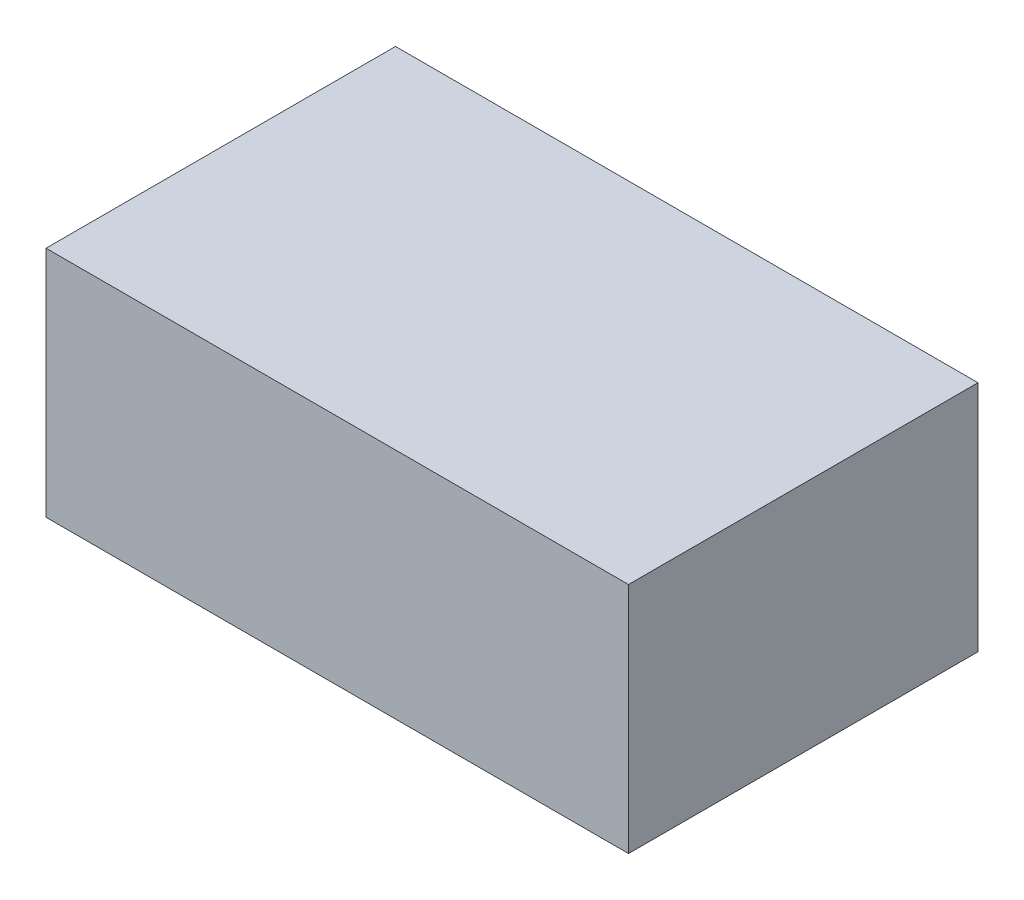
ISO-10303-21;
HEADER;
FILE_DESCRIPTION(('STEP AP214'),'2;1');
FILE_NAME('part.step','',(''),(''),'','','');
FILE_SCHEMA(('AUTOMOTIVE_DESIGN { 1 0 10303 214 1 1 1 1 }'));
ENDSEC;
DATA;
#1=APPLICATION_CONTEXT('core data for automotive mechanical design processes');
#2=APPLICATION_PROTOCOL_DEFINITION('international standard','automotive_design',2000,#1);
#3=PRODUCT_CONTEXT('',#1,'mechanical');
#4=PRODUCT('Part','Part','',(#3));
#5=PRODUCT_RELATED_PRODUCT_CATEGORY('part','',(#4));
#6=PRODUCT_DEFINITION_FORMATION('','',#4);
#7=PRODUCT_DEFINITION_CONTEXT('part definition',#1,'design');
#8=PRODUCT_DEFINITION('design','',#6,#7);
#9=PRODUCT_DEFINITION_SHAPE('','',#8);
#10=(LENGTH_UNIT() NAMED_UNIT(*) SI_UNIT(.MILLI.,.METRE.));
#11=(NAMED_UNIT(*) PLANE_ANGLE_UNIT() SI_UNIT($,.RADIAN.));
#12=(NAMED_UNIT(*) SI_UNIT($,.STERADIAN.) SOLID_ANGLE_UNIT());
#13=UNCERTAINTY_MEASURE_WITH_UNIT(LENGTH_MEASURE(1.E-05),#10,'distance_accuracy_value','');
#14=(GEOMETRIC_REPRESENTATION_CONTEXT(3) GLOBAL_UNCERTAINTY_ASSIGNED_CONTEXT((#13)) GLOBAL_UNIT_ASSIGNED_CONTEXT((#10,
#11,#12)) REPRESENTATION_CONTEXT('',''));
#15=CARTESIAN_POINT('',(0.,0.,0.));
#16=DIRECTION('',(0.,0.,1.));
#17=DIRECTION('',(1.,0.,0.));
#18=AXIS2_PLACEMENT_3D('',#15,#16,#17);
#19=CARTESIAN_POINT('',(0.,0.,0.));
#20=DIRECTION('',(0.,1.,0.));
#21=DIRECTION('',(0.,0.,1.));
#22=AXIS2_PLACEMENT_3D('',#19,#20,#21);
#23=PLANE('',#22);
#24=DIRECTION('',(-1.,0.,0.));
#25=VECTOR('',#24,1.);
#26=CARTESIAN_POINT('',(3.28353129210385,0.,-14.4048659910961));
#27=LINE('',#26,#25);
#28=CARTESIAN_POINT('',(14.9430099475817,0.,-14.4048659910961));
#29=VERTEX_POINT('',#28);
#30=CARTESIAN_POINT('',(3.28353129210385,0.,-14.4048659910961));
#31=VERTEX_POINT('',#30);
#32=EDGE_CURVE('E79',#29,#31,#27,.T.);
#33=ORIENTED_EDGE('',*,*,#32,.F.);
#34=DIRECTION('',(0.576438296507563,0.,-0.817140679638127));
#35=VECTOR('',#34,1.);
#36=CARTESIAN_POINT('',(12.692574419648,0.,-11.2147198333566));
#37=LINE('',#36,#35);
#38=CARTESIAN_POINT('',(8.77961574684437,0.,-5.66783349935892));
#39=VERTEX_POINT('',#38);
#40=EDGE_CURVE('E177',#39,#29,#37,.T.);
#41=ORIENTED_EDGE('',*,*,#40,.F.);
#42=CARTESIAN_POINT('',(1.28453532487361,0.,-10.9551132766199));
#43=DIRECTION('',(0.,1.,0.));
#44=DIRECTION('',(0.,0.,-1.));
#45=AXIS2_PLACEMENT_3D('',#42,#43,#44);
#46=CIRCLE('',#45,9.17232565791483);
#47=CARTESIAN_POINT('',(3.28353129210386,0.,-2.00326580820093));
#48=VERTEX_POINT('',#47);
#49=EDGE_CURVE('E174',#48,#39,#46,.T.);
#50=ORIENTED_EDGE('',*,*,#49,.F.);
#51=DIRECTION('',(0.,0.,1.));
#52=VECTOR('',#51,1.);
#53=CARTESIAN_POINT('',(3.28353129210385,0.,-14.4048659910961));
#54=LINE('',#53,#52);
#55=EDGE_CURVE('E203',#31,#48,#54,.T.);
#56=ORIENTED_EDGE('',*,*,#55,.F.);
#57=EDGE_LOOP('',(#33,#41,#50,#56));
#58=FACE_BOUND('',#57,.T.);
#59=ADVANCED_FACE('F34',(#58),#23,.F.);
#60=CARTESIAN_POINT('',(3.28353129210385,10.,-14.4048659910961));
#61=DIRECTION('',(1.,0.,0.));
#62=DIRECTION('',(0.,0.,-1.));
#63=AXIS2_PLACEMENT_3D('',#60,#61,#62);
#64=PLANE('',#63);
#65=ORIENTED_EDGE('',*,*,#55,.T.);
#66=DIRECTION('',(0.,-1.,0.));
#67=VECTOR('',#66,1.);
#68=CARTESIAN_POINT('',(3.28353129210386,2.,-2.00326580820093));
#69=LINE('',#68,#67);
#70=CARTESIAN_POINT('',(3.28353129210386,2.,-2.00326580820093));
#71=VERTEX_POINT('',#70);
#72=EDGE_CURVE('E192',#71,#48,#69,.T.);
#73=ORIENTED_EDGE('',*,*,#72,.F.);
#74=DIRECTION('',(0.,0.,-1.));
#75=VECTOR('',#74,1.);
#76=CARTESIAN_POINT('',(3.28353129210386,2.,-1.1899662611907));
#77=LINE('',#76,#75);
#78=CARTESIAN_POINT('',(3.28353129210386,2.,-1.1899662611907));
#79=VERTEX_POINT('',#78);
#80=EDGE_CURVE('E147',#79,#71,#77,.T.);
#81=ORIENTED_EDGE('',*,*,#80,.F.);
#82=DIRECTION('',(0.,-1.,0.));
#83=VECTOR('',#82,1.);
#84=CARTESIAN_POINT('',(3.28353129210386,2.,-1.1899662611907));
#85=LINE('',#84,#83);
#86=CARTESIAN_POINT('',(3.28353129210386,0.,-1.1899662611907));
#87=VERTEX_POINT('',#86);
#88=EDGE_CURVE('E137',#79,#87,#85,.T.);
#89=ORIENTED_EDGE('',*,*,#88,.T.);
#90=CARTESIAN_POINT('',(3.28353129210386,0.,0.595134008903904));
#91=VERTEX_POINT('',#90);
#92=EDGE_CURVE('E183',#87,#91,#54,.T.);
#93=ORIENTED_EDGE('',*,*,#92,.T.);
#94=DIRECTION('',(0.,-1.,0.));
#95=VECTOR('',#94,1.);
#96=CARTESIAN_POINT('',(3.28353129210386,10.,0.595134008903904));
#97=LINE('',#96,#95);
#98=CARTESIAN_POINT('',(3.28353129210386,10.,0.595134008903904));
#99=VERTEX_POINT('',#98);
#100=EDGE_CURVE('E11',#99,#91,#97,.T.);
#101=ORIENTED_EDGE('',*,*,#100,.F.);
#102=DIRECTION('',(0.,0.,1.));
#103=VECTOR('',#102,1.);
#104=CARTESIAN_POINT('',(3.28353129210385,10.,-14.4048659910961));
#105=LINE('',#104,#103);
#106=CARTESIAN_POINT('',(3.28353129210385,10.,-14.4048659910961));
#107=VERTEX_POINT('',#106);
#108=EDGE_CURVE('E195',#107,#99,#105,.T.);
#109=ORIENTED_EDGE('',*,*,#108,.F.);
#110=DIRECTION('',(0.,-1.,0.));
#111=VECTOR('',#110,1.);
#112=CARTESIAN_POINT('',(3.28353129210385,10.,-14.4048659910961));
#113=LINE('',#112,#111);
#114=EDGE_CURVE('E202',#107,#31,#113,.T.);
#115=ORIENTED_EDGE('',*,*,#114,.T.);
#116=EDGE_LOOP('',(#65,#73,#81,#89,#93,#101,#109,#115));
#117=FACE_BOUND('',#116,.T.);
#118=ADVANCED_FACE('F36',(#117),#64,.F.);
#119=CARTESIAN_POINT('',(3.28353129210386,10.,0.595134008903904));
#120=DIRECTION('',(0.,0.,-1.));
#121=DIRECTION('',(-1.,0.,0.));
#122=AXIS2_PLACEMENT_3D('',#119,#120,#121);
#123=PLANE('',#122);
#124=DIRECTION('',(1.,0.,0.));
#125=VECTOR('',#124,1.);
#126=CARTESIAN_POINT('',(3.28353129210386,0.,0.595134008903904));
#127=LINE('',#126,#125);
#128=CARTESIAN_POINT('',(28.2835312921039,0.,0.595134008903904));
#129=VERTEX_POINT('',#128);
#130=EDGE_CURVE('E206',#91,#129,#127,.T.);
#131=ORIENTED_EDGE('',*,*,#130,.T.);
#132=DIRECTION('',(0.,-1.,0.));
#133=VECTOR('',#132,1.);
#134=CARTESIAN_POINT('',(28.2835312921039,10.,0.595134008903904));
#135=LINE('',#134,#133);
#136=CARTESIAN_POINT('',(28.2835312921039,10.,0.595134008903904));
#137=VERTEX_POINT('',#136);
#138=EDGE_CURVE('E42',#137,#129,#135,.T.);
#139=ORIENTED_EDGE('',*,*,#138,.F.);
#140=DIRECTION('',(1.,0.,0.));
#141=VECTOR('',#140,1.);
#142=CARTESIAN_POINT('',(3.28353129210386,10.,0.595134008903904));
#143=LINE('',#142,#141);
#144=EDGE_CURVE('E86',#99,#137,#143,.T.);
#145=ORIENTED_EDGE('',*,*,#144,.F.);
#146=ORIENTED_EDGE('',*,*,#100,.T.);
#147=EDGE_LOOP('',(#131,#139,#145,#146));
#148=FACE_BOUND('',#147,.T.);
#149=ADVANCED_FACE('F250',(#148),#123,.F.);
#150=CARTESIAN_POINT('',(28.2835312921039,10.,-14.4048659910961));
#151=DIRECTION('',(-1.,0.,0.));
#152=DIRECTION('',(0.,0.,1.));
#153=AXIS2_PLACEMENT_3D('',#150,#151,#152);
#154=PLANE('',#153);
#155=DIRECTION('',(0.,0.,-1.));
#156=VECTOR('',#155,1.);
#157=CARTESIAN_POINT('',(28.2835312921039,0.,-14.4048659910961));
#158=LINE('',#157,#156);
#159=CARTESIAN_POINT('',(28.2835312921039,0.,-14.4048659910961));
#160=VERTEX_POINT('',#159);
#161=EDGE_CURVE('E208',#129,#160,#158,.T.);
#162=ORIENTED_EDGE('',*,*,#161,.T.);
#163=DIRECTION('',(0.,-1.,0.));
#164=VECTOR('',#163,1.);
#165=CARTESIAN_POINT('',(28.2835312921039,10.,-14.4048659910961));
#166=LINE('',#165,#164);
#167=CARTESIAN_POINT('',(28.2835312921039,10.,-14.4048659910961));
#168=VERTEX_POINT('',#167);
#169=EDGE_CURVE('E213',#168,#160,#166,.T.);
#170=ORIENTED_EDGE('',*,*,#169,.F.);
#171=DIRECTION('',(0.,0.,-1.));
#172=VECTOR('',#171,1.);
#173=CARTESIAN_POINT('',(28.2835312921039,10.,-14.4048659910961));
#174=LINE('',#173,#172);
#175=EDGE_CURVE('E199',#137,#168,#174,.T.);
#176=ORIENTED_EDGE('',*,*,#175,.F.);
#177=ORIENTED_EDGE('',*,*,#138,.T.);
#178=EDGE_LOOP('',(#162,#170,#176,#177));
#179=FACE_BOUND('',#178,.T.);
#180=ADVANCED_FACE('F219',(#179),#154,.F.);
#181=CARTESIAN_POINT('',(3.28353129210385,10.,-14.4048659910961));
#182=DIRECTION('',(0.,0.,1.));
#183=DIRECTION('',(1.,0.,0.));
#184=AXIS2_PLACEMENT_3D('',#181,#182,#183);
#185=PLANE('',#184);
#186=CARTESIAN_POINT('',(15.9388803821953,0.,-14.4048659910961));
#187=VERTEX_POINT('',#186);
#188=EDGE_CURVE('E197',#160,#187,#27,.T.);
#189=ORIENTED_EDGE('',*,*,#188,.T.);
#190=DIRECTION('',(0.,-1.,0.));
#191=VECTOR('',#190,1.);
#192=CARTESIAN_POINT('',(15.9388803821953,2.,-14.4048659910961));
#193=LINE('',#192,#191);
#194=CARTESIAN_POINT('',(15.9388803821953,2.,-14.4048659910961));
#195=VERTEX_POINT('',#194);
#196=EDGE_CURVE('E186',#195,#187,#193,.T.);
#197=ORIENTED_EDGE('',*,*,#196,.F.);
#198=DIRECTION('',(1.,0.,0.));
#199=VECTOR('',#198,1.);
#200=CARTESIAN_POINT('',(14.9430099475817,2.,-14.4048659910961));
#201=LINE('',#200,#199);
#202=CARTESIAN_POINT('',(14.9430099475817,2.,-14.4048659910961));
#203=VERTEX_POINT('',#202);
#204=EDGE_CURVE('E165',#203,#195,#201,.T.);
#205=ORIENTED_EDGE('',*,*,#204,.F.);
#206=DIRECTION('',(0.,-1.,0.));
#207=VECTOR('',#206,1.);
#208=CARTESIAN_POINT('',(14.9430099475817,2.,-14.4048659910961));
#209=LINE('',#208,#207);
#210=EDGE_CURVE('E188',#203,#29,#209,.T.);
#211=ORIENTED_EDGE('',*,*,#210,.T.);
#212=ORIENTED_EDGE('',*,*,#32,.T.);
#213=ORIENTED_EDGE('',*,*,#114,.F.);
#214=DIRECTION('',(-1.,0.,0.));
#215=VECTOR('',#214,1.);
#216=CARTESIAN_POINT('',(3.28353129210385,10.,-14.4048659910961));
#217=LINE('',#216,#215);
#218=EDGE_CURVE('E58',#168,#107,#217,.T.);
#219=ORIENTED_EDGE('',*,*,#218,.F.);
#220=ORIENTED_EDGE('',*,*,#169,.T.);
#221=EDGE_LOOP('',(#189,#197,#205,#211,#212,#213,#219,#220));
#222=FACE_BOUND('',#221,.T.);
#223=ADVANCED_FACE('F229',(#222),#185,.F.);
#224=CARTESIAN_POINT('',(0.,10.,0.));
#225=DIRECTION('',(0.,1.,0.));
#226=DIRECTION('',(0.,0.,1.));
#227=AXIS2_PLACEMENT_3D('',#224,#225,#226);
#228=PLANE('',#227);
#229=ORIENTED_EDGE('',*,*,#108,.T.);
#230=ORIENTED_EDGE('',*,*,#144,.T.);
#231=ORIENTED_EDGE('',*,*,#175,.T.);
#232=ORIENTED_EDGE('',*,*,#218,.T.);
#233=EDGE_LOOP('',(#229,#230,#231,#232));
#234=FACE_BOUND('',#233,.T.);
#235=ADVANCED_FACE('F235',(#234),#228,.T.);
#236=DIRECTION('',(-0.576438296507563,0.,0.817140679638127));
#237=VECTOR('',#236,1.);
#238=CARTESIAN_POINT('',(9.42822116130713,0.,-5.21028560150604));
#239=LINE('',#238,#237);
#240=CARTESIAN_POINT('',(15.5916153620445,0.,-13.9473180932432));
#241=VERTEX_POINT('',#240);
#242=CARTESIAN_POINT('',(9.42822116130713,0.,-5.21028560150604));
#243=VERTEX_POINT('',#242);
#244=EDGE_CURVE('E153',#241,#243,#239,.T.);
#245=ORIENTED_EDGE('',*,*,#244,.F.);
#246=DIRECTION('',(-0.60456295462272,0.,0.79655736384635));
#247=VECTOR('',#246,1.);
#248=CARTESIAN_POINT('',(15.5916153620445,0.,-13.9473180932432));
#249=LINE('',#248,#247);
#250=EDGE_CURVE('E156',#187,#241,#249,.T.);
#251=ORIENTED_EDGE('',*,*,#250,.F.);
#252=ORIENTED_EDGE('',*,*,#188,.F.);
#253=ORIENTED_EDGE('',*,*,#161,.F.);
#254=ORIENTED_EDGE('',*,*,#130,.F.);
#255=ORIENTED_EDGE('',*,*,#92,.F.);
#256=DIRECTION('',(-0.975962673184686,0.,0.217937744666225));
#257=VECTOR('',#256,1.);
#258=CARTESIAN_POINT('',(3.45651937693268,0.,-1.22859543636059));
#259=LINE('',#258,#257);
#260=CARTESIAN_POINT('',(3.45651937693268,0.,-1.22859543636059));
#261=VERTEX_POINT('',#260);
#262=EDGE_CURVE('E172',#261,#87,#259,.T.);
#263=ORIENTED_EDGE('',*,*,#262,.F.);
#264=CARTESIAN_POINT('',(1.28453532487361,0.,-10.9551132766199));
#265=DIRECTION('',(0.,-1.,0.));
#266=DIRECTION('',(0.,0.,-1.));
#267=AXIS2_PLACEMENT_3D('',#264,#265,#266);
#268=CIRCLE('',#267,9.96607565791483);
#269=EDGE_CURVE('E49',#243,#261,#268,.T.);
#270=ORIENTED_EDGE('',*,*,#269,.F.);
#271=EDGE_LOOP('',(#245,#251,#252,#253,#254,#255,#263,#270));
#272=FACE_BOUND('',#271,.T.);
#273=ADVANCED_FACE('F225',(#272),#23,.F.);
#274=CARTESIAN_POINT('',(1.28453532487361,2.,-10.9551132766199));
#275=DIRECTION('',(0.,-1.,0.));
#276=DIRECTION('',(0.,0.,-1.));
#277=AXIS2_PLACEMENT_3D('',#274,#275,#276);
#278=CYLINDRICAL_SURFACE('',#277,9.96607565791483);
#279=ORIENTED_EDGE('',*,*,#269,.T.);
#280=DIRECTION('',(0.,-1.,0.));
#281=VECTOR('',#280,1.);
#282=CARTESIAN_POINT('',(3.45651937693268,2.,-1.22859543636059));
#283=LINE('',#282,#281);
#284=CARTESIAN_POINT('',(3.45651937693268,2.,-1.22859543636059));
#285=VERTEX_POINT('',#284);
#286=EDGE_CURVE('E130',#285,#261,#283,.T.);
#287=ORIENTED_EDGE('',*,*,#286,.F.);
#288=CARTESIAN_POINT('',(1.28453532487361,2.,-10.9551132766199));
#289=DIRECTION('',(0.,-1.,0.));
#290=DIRECTION('',(0.,0.,-1.));
#291=AXIS2_PLACEMENT_3D('',#288,#289,#290);
#292=CIRCLE('',#291,9.96607565791483);
#293=CARTESIAN_POINT('',(9.42822116130713,2.,-5.21028560150604));
#294=VERTEX_POINT('',#293);
#295=EDGE_CURVE('E134',#294,#285,#292,.T.);
#296=ORIENTED_EDGE('',*,*,#295,.F.);
#297=DIRECTION('',(0.,-1.,0.));
#298=VECTOR('',#297,1.);
#299=CARTESIAN_POINT('',(9.42822116130713,2.,-5.21028560150604));
#300=LINE('',#299,#298);
#301=EDGE_CURVE('E181',#294,#243,#300,.T.);
#302=ORIENTED_EDGE('',*,*,#301,.T.);
#303=EDGE_LOOP('',(#279,#287,#296,#302));
#304=FACE_BOUND('',#303,.T.);
#305=ADVANCED_FACE('F132',(#304),#278,.F.);
#306=CARTESIAN_POINT('',(9.42822116130713,2.,-5.21028560150604));
#307=DIRECTION('',(0.817140679638127,0.,0.576438296507563));
#308=DIRECTION('',(0.576438296507563,0.,-0.817140679638127));
#309=AXIS2_PLACEMENT_3D('',#306,#307,#308);
#310=PLANE('',#309);
#311=ORIENTED_EDGE('',*,*,#244,.T.);
#312=ORIENTED_EDGE('',*,*,#301,.F.);
#313=DIRECTION('',(-0.576438296507563,0.,0.817140679638127));
#314=VECTOR('',#313,1.);
#315=CARTESIAN_POINT('',(13.3411798341108,2.,-10.7571719355037));
#316=LINE('',#315,#314);
#317=CARTESIAN_POINT('',(15.5916153620445,2.,-13.9473180932432));
#318=VERTEX_POINT('',#317);
#319=EDGE_CURVE('E138',#318,#294,#316,.T.);
#320=ORIENTED_EDGE('',*,*,#319,.F.);
#321=DIRECTION('',(0.,-1.,0.));
#322=VECTOR('',#321,1.);
#323=CARTESIAN_POINT('',(15.5916153620445,2.,-13.9473180932432));
#324=LINE('',#323,#322);
#325=EDGE_CURVE('E184',#318,#241,#324,.T.);
#326=ORIENTED_EDGE('',*,*,#325,.T.);
#327=EDGE_LOOP('',(#311,#312,#320,#326));
#328=FACE_BOUND('',#327,.T.);
#329=ADVANCED_FACE('F285',(#328),#310,.F.);
#330=CARTESIAN_POINT('',(15.5916153620445,2.,-13.9473180932432));
#331=DIRECTION('',(0.79655736384635,0.,0.60456295462272));
#332=DIRECTION('',(0.60456295462272,0.,-0.79655736384635));
#333=AXIS2_PLACEMENT_3D('',#330,#331,#332);
#334=PLANE('',#333);
#335=ORIENTED_EDGE('',*,*,#250,.T.);
#336=ORIENTED_EDGE('',*,*,#325,.F.);
#337=DIRECTION('',(-0.60456295462272,0.,0.79655736384635));
#338=VECTOR('',#337,1.);
#339=CARTESIAN_POINT('',(15.5916153620445,2.,-13.9473180932432));
#340=LINE('',#339,#338);
#341=EDGE_CURVE('E168',#195,#318,#340,.T.);
#342=ORIENTED_EDGE('',*,*,#341,.F.);
#343=ORIENTED_EDGE('',*,*,#196,.T.);
#344=EDGE_LOOP('',(#335,#336,#342,#343));
#345=FACE_BOUND('',#344,.T.);
#346=ADVANCED_FACE('F294',(#345),#334,.F.);
#347=CARTESIAN_POINT('',(12.692574419648,2.,-11.2147198333566));
#348=DIRECTION('',(-0.817140679638127,0.,-0.576438296507563));
#349=DIRECTION('',(-0.576438296507563,0.,0.817140679638127));
#350=AXIS2_PLACEMENT_3D('',#347,#348,#349);
#351=PLANE('',#350);
#352=ORIENTED_EDGE('',*,*,#40,.T.);
#353=ORIENTED_EDGE('',*,*,#210,.F.);
#354=DIRECTION('',(0.576438296507562,0.,-0.817140679638127));
#355=VECTOR('',#354,1.);
#356=CARTESIAN_POINT('',(8.77961574684437,2.,-5.66783349935892));
#357=LINE('',#356,#355);
#358=CARTESIAN_POINT('',(8.77961574684437,2.,-5.66783349935892));
#359=VERTEX_POINT('',#358);
#360=EDGE_CURVE('E163',#359,#203,#357,.T.);
#361=ORIENTED_EDGE('',*,*,#360,.F.);
#362=DIRECTION('',(0.,-1.,0.));
#363=VECTOR('',#362,1.);
#364=CARTESIAN_POINT('',(8.77961574684437,2.,-5.66783349935892));
#365=LINE('',#364,#363);
#366=EDGE_CURVE('E190',#359,#39,#365,.T.);
#367=ORIENTED_EDGE('',*,*,#366,.T.);
#368=EDGE_LOOP('',(#352,#353,#361,#367));
#369=FACE_BOUND('',#368,.T.);
#370=ADVANCED_FACE('F304',(#369),#351,.F.);
#371=CARTESIAN_POINT('',(1.28453532487361,2.,-10.9551132766199));
#372=DIRECTION('',(0.,-1.,0.));
#373=DIRECTION('',(0.,0.,-1.));
#374=AXIS2_PLACEMENT_3D('',#371,#372,#373);
#375=CYLINDRICAL_SURFACE('',#374,9.17232565791483);
#376=ORIENTED_EDGE('',*,*,#49,.T.);
#377=ORIENTED_EDGE('',*,*,#366,.F.);
#378=CARTESIAN_POINT('',(1.28453532487361,2.,-10.9551132766199));
#379=DIRECTION('',(0.,1.,0.));
#380=DIRECTION('',(0.,0.,-1.));
#381=AXIS2_PLACEMENT_3D('',#378,#379,#380);
#382=CIRCLE('',#381,9.17232565791483);
#383=EDGE_CURVE('E160',#71,#359,#382,.T.);
#384=ORIENTED_EDGE('',*,*,#383,.F.);
#385=ORIENTED_EDGE('',*,*,#72,.T.);
#386=EDGE_LOOP('',(#376,#377,#384,#385));
#387=FACE_BOUND('',#386,.T.);
#388=ADVANCED_FACE('F315',(#387),#375,.T.);
#389=CARTESIAN_POINT('',(3.45651937693268,2.,-1.22859543636059));
#390=DIRECTION('',(0.217937744666225,0.,0.975962673184687));
#391=DIRECTION('',(0.975962673184687,0.,-0.217937744666225));
#392=AXIS2_PLACEMENT_3D('',#389,#390,#391);
#393=PLANE('',#392);
#394=ORIENTED_EDGE('',*,*,#262,.T.);
#395=ORIENTED_EDGE('',*,*,#88,.F.);
#396=DIRECTION('',(-0.975962673184686,0.,0.217937744666225));
#397=VECTOR('',#396,1.);
#398=CARTESIAN_POINT('',(3.45651937693268,2.,-1.22859543636059));
#399=LINE('',#398,#397);
#400=EDGE_CURVE('E141',#285,#79,#399,.T.);
#401=ORIENTED_EDGE('',*,*,#400,.F.);
#402=ORIENTED_EDGE('',*,*,#286,.T.);
#403=EDGE_LOOP('',(#394,#395,#401,#402));
#404=FACE_BOUND('',#403,.T.);
#405=ADVANCED_FACE('F142',(#404),#393,.F.);
#406=CARTESIAN_POINT('',(1.28453532487361,2.,-10.9551132766199));
#407=DIRECTION('',(0.,-1.,0.));
#408=DIRECTION('',(0.,0.,-1.));
#409=AXIS2_PLACEMENT_3D('',#406,#407,#408);
#410=PLANE('',#409);
#411=ORIENTED_EDGE('',*,*,#295,.T.);
#412=ORIENTED_EDGE('',*,*,#400,.T.);
#413=ORIENTED_EDGE('',*,*,#80,.T.);
#414=ORIENTED_EDGE('',*,*,#383,.T.);
#415=ORIENTED_EDGE('',*,*,#360,.T.);
#416=ORIENTED_EDGE('',*,*,#204,.T.);
#417=ORIENTED_EDGE('',*,*,#341,.T.);
#418=ORIENTED_EDGE('',*,*,#319,.T.);
#419=EDGE_LOOP('',(#411,#412,#413,#414,#415,#416,#417,#418));
#420=FACE_BOUND('',#419,.T.);
#421=ADVANCED_FACE('F149',(#420),#410,.T.);
#422=CLOSED_SHELL('',(#59,#118,#149,#180,#223,#235,#273,#305,#329,#346,#370,#388,#405,#421));
#423=MANIFOLD_SOLID_BREP('B2',#422);
#424=ADVANCED_BREP_SHAPE_REPRESENTATION('',(#18,#423),#14);
#425=SHAPE_DEFINITION_REPRESENTATION(#9,#424);
ENDSEC;
END-ISO-10303-21;
